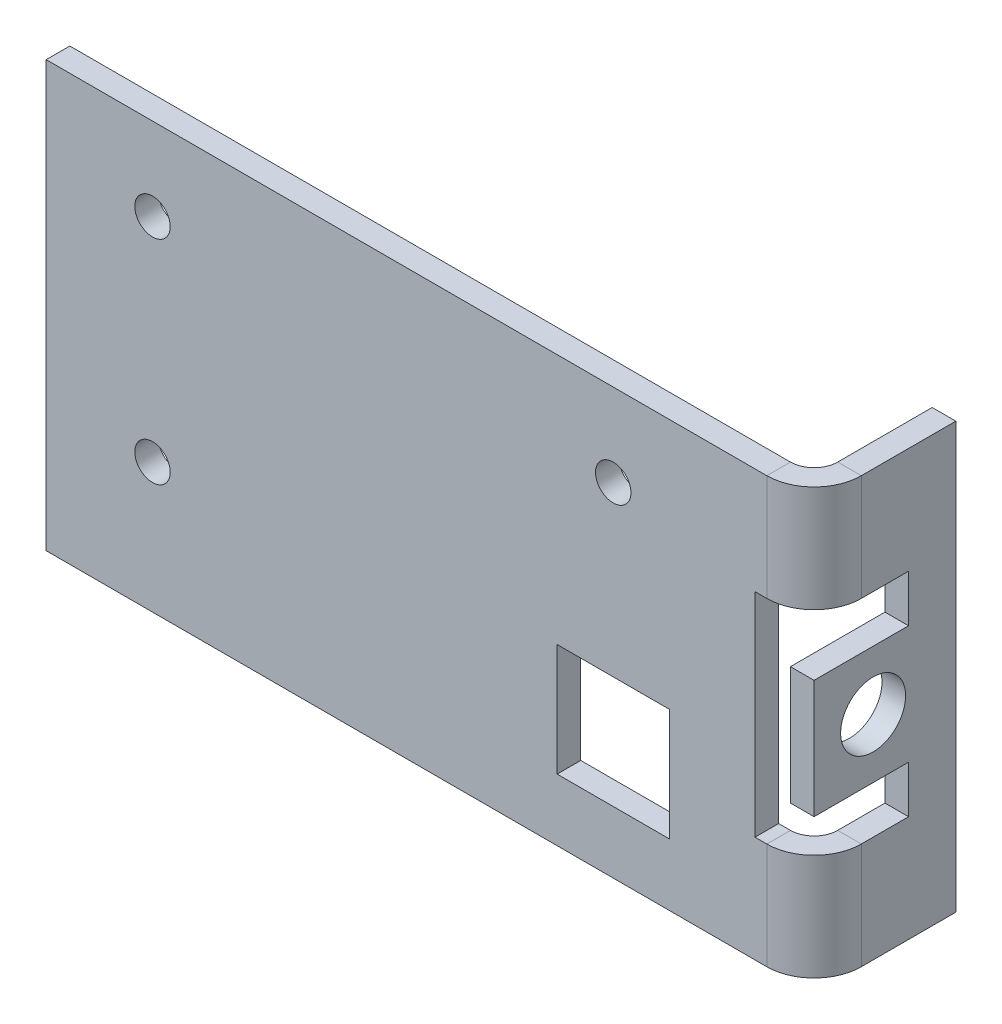
ISO-10303-21;
HEADER;
FILE_DESCRIPTION(('STEP AP214'),'2;1');
FILE_NAME('part.step','',(''),(''),'','','');
FILE_SCHEMA(('AUTOMOTIVE_DESIGN { 1 0 10303 214 1 1 1 1 }'));
ENDSEC;
DATA;
#1=APPLICATION_CONTEXT('core data for automotive mechanical design processes');
#2=APPLICATION_PROTOCOL_DEFINITION('international standard','automotive_design',2000,#1);
#3=PRODUCT_CONTEXT('',#1,'mechanical');
#4=PRODUCT('Part','Part','',(#3));
#5=PRODUCT_RELATED_PRODUCT_CATEGORY('part','',(#4));
#6=PRODUCT_DEFINITION_FORMATION('','',#4);
#7=PRODUCT_DEFINITION_CONTEXT('part definition',#1,'design');
#8=PRODUCT_DEFINITION('design','',#6,#7);
#9=PRODUCT_DEFINITION_SHAPE('','',#8);
#10=(LENGTH_UNIT() NAMED_UNIT(*) SI_UNIT(.MILLI.,.METRE.));
#11=(NAMED_UNIT(*) PLANE_ANGLE_UNIT() SI_UNIT($,.RADIAN.));
#12=(NAMED_UNIT(*) SI_UNIT($,.STERADIAN.) SOLID_ANGLE_UNIT());
#13=UNCERTAINTY_MEASURE_WITH_UNIT(LENGTH_MEASURE(1.E-05),#10,'distance_accuracy_value','');
#14=(GEOMETRIC_REPRESENTATION_CONTEXT(3) GLOBAL_UNCERTAINTY_ASSIGNED_CONTEXT((#13)) GLOBAL_UNIT_ASSIGNED_CONTEXT((#10,
#11,#12)) REPRESENTATION_CONTEXT('',''));
#15=CARTESIAN_POINT('',(0.,0.,0.));
#16=DIRECTION('',(0.,0.,1.));
#17=DIRECTION('',(1.,0.,0.));
#18=AXIS2_PLACEMENT_3D('',#15,#16,#17);
#19=CARTESIAN_POINT('',(-8.00000000000004,36.,-10.));
#20=DIRECTION('',(1.,0.,0.));
#21=DIRECTION('',(0.,0.,-1.));
#22=AXIS2_PLACEMENT_3D('',#19,#20,#21);
#23=PLANE('',#22);
#24=CARTESIAN_POINT('',(-8.00000000000002,18.,-3.));
#25=DIRECTION('',(1.,0.,0.));
#26=DIRECTION('',(0.,0.,-1.));
#27=AXIS2_PLACEMENT_3D('',#24,#25,#26);
#28=CIRCLE('',#27,2.75);
#29=CARTESIAN_POINT('',(-8.00000000000003,18.,-5.75));
#30=VERTEX_POINT('',#29);
#31=EDGE_CURVE('E416',#30,#30,#28,.T.);
#32=ORIENTED_EDGE('',*,*,#31,.F.);
#33=EDGE_LOOP('',(#32));
#34=FACE_BOUND('',#33,.T.);
#35=DIRECTION('',(0.,0.,-1.));
#36=VECTOR('',#35,1.);
#37=CARTESIAN_POINT('',(-7.99999999999999,9.,3.));
#38=LINE('',#37,#36);
#39=CARTESIAN_POINT('',(-8.00000000839993,8.99999999999999,-2.));
#40=VERTEX_POINT('',#39);
#41=CARTESIAN_POINT('',(-8.00000000000003,9.,-6.));
#42=VERTEX_POINT('',#41);
#43=EDGE_CURVE('E243',#40,#42,#38,.T.);
#44=ORIENTED_EDGE('',*,*,#43,.F.);
#45=DIRECTION('',(0.,-1.,0.));
#46=VECTOR('',#45,1.);
#47=CARTESIAN_POINT('',(-8.00000000000001,36.,-2.00000000000002));
#48=LINE('',#47,#46);
#49=CARTESIAN_POINT('',(-8.00000000000001,0.,-2.));
#50=VERTEX_POINT('',#49);
#51=EDGE_CURVE('E210',#40,#50,#48,.T.);
#52=ORIENTED_EDGE('',*,*,#51,.T.);
#53=DIRECTION('',(0.,0.,-1.));
#54=VECTOR('',#53,1.);
#55=CARTESIAN_POINT('',(-8.00000000000004,0.,-10.));
#56=LINE('',#55,#54);
#57=CARTESIAN_POINT('',(-8.00000000000004,0.,-10.));
#58=VERTEX_POINT('',#57);
#59=EDGE_CURVE('E250',#50,#58,#56,.T.);
#60=ORIENTED_EDGE('',*,*,#59,.T.);
#61=DIRECTION('',(0.,1.,0.));
#62=VECTOR('',#61,1.);
#63=CARTESIAN_POINT('',(-8.00000000000004,0.,-10.));
#64=LINE('',#63,#62);
#65=CARTESIAN_POINT('',(-8.00000000000004,36.,-10.));
#66=VERTEX_POINT('',#65);
#67=EDGE_CURVE('E248',#58,#66,#64,.T.);
#68=ORIENTED_EDGE('',*,*,#67,.T.);
#69=DIRECTION('',(0.,0.,1.));
#70=VECTOR('',#69,1.);
#71=CARTESIAN_POINT('',(-8.00000000000004,36.,-10.));
#72=LINE('',#71,#70);
#73=CARTESIAN_POINT('',(-8.00000000839993,36.,-2.00000000000001));
#74=VERTEX_POINT('',#73);
#75=EDGE_CURVE('E253',#66,#74,#72,.T.);
#76=ORIENTED_EDGE('',*,*,#75,.T.);
#77=DIRECTION('',(0.,-1.,0.));
#78=VECTOR('',#77,1.);
#79=CARTESIAN_POINT('',(-8.00000000000001,36.,-2.00000000000001));
#80=LINE('',#79,#78);
#81=CARTESIAN_POINT('',(-8.00000000000001,27.,-2.00000000000001));
#82=VERTEX_POINT('',#81);
#83=EDGE_CURVE('E428',#74,#82,#80,.T.);
#84=ORIENTED_EDGE('',*,*,#83,.T.);
#85=DIRECTION('',(0.,0.,1.));
#86=VECTOR('',#85,1.);
#87=CARTESIAN_POINT('',(-8.00000000000003,27.,-6.));
#88=LINE('',#87,#86);
#89=CARTESIAN_POINT('',(-8.00000000000003,27.,-6.));
#90=VERTEX_POINT('',#89);
#91=EDGE_CURVE('E245',#90,#82,#88,.T.);
#92=ORIENTED_EDGE('',*,*,#91,.F.);
#93=DIRECTION('',(0.,1.,0.));
#94=VECTOR('',#93,1.);
#95=CARTESIAN_POINT('',(-8.00000000000003,23.,-6.));
#96=LINE('',#95,#94);
#97=CARTESIAN_POINT('',(-8.00000000000003,23.,-6.));
#98=VERTEX_POINT('',#97);
#99=EDGE_CURVE('E256',#98,#90,#96,.T.);
#100=ORIENTED_EDGE('',*,*,#99,.F.);
#101=DIRECTION('',(0.,0.,-1.));
#102=VECTOR('',#101,1.);
#103=CARTESIAN_POINT('',(-8.,23.,2.));
#104=LINE('',#103,#102);
#105=CARTESIAN_POINT('',(-8.,23.,2.));
#106=VERTEX_POINT('',#105);
#107=EDGE_CURVE('E398',#106,#98,#104,.T.);
#108=ORIENTED_EDGE('',*,*,#107,.F.);
#109=DIRECTION('',(0.,1.,0.));
#110=VECTOR('',#109,1.);
#111=CARTESIAN_POINT('',(-8.,13.,2.));
#112=LINE('',#111,#110);
#113=CARTESIAN_POINT('',(-8.,13.,2.));
#114=VERTEX_POINT('',#113);
#115=EDGE_CURVE('E395',#114,#106,#112,.T.);
#116=ORIENTED_EDGE('',*,*,#115,.F.);
#117=DIRECTION('',(0.,0.,1.));
#118=VECTOR('',#117,1.);
#119=CARTESIAN_POINT('',(-8.00000000000003,13.,-6.));
#120=LINE('',#119,#118);
#121=CARTESIAN_POINT('',(-8.00000000000003,13.,-6.));
#122=VERTEX_POINT('',#121);
#123=EDGE_CURVE('E393',#122,#114,#120,.T.);
#124=ORIENTED_EDGE('',*,*,#123,.F.);
#125=DIRECTION('',(0.,1.,0.));
#126=VECTOR('',#125,1.);
#127=CARTESIAN_POINT('',(-8.00000000000003,9.,-6.));
#128=LINE('',#127,#126);
#129=EDGE_CURVE('E244',#42,#122,#128,.T.);
#130=ORIENTED_EDGE('',*,*,#129,.F.);
#131=EDGE_LOOP('',(#44,#52,#60,#68,#76,#84,#92,#100,#108,#116,#124,#130));
#132=FACE_BOUND('',#131,.T.);
#133=ADVANCED_FACE('F36',(#34,#132),#23,.T.);
#134=CARTESIAN_POINT('',(-7.99999999999999,9.,3.));
#135=DIRECTION('',(0.,1.,0.));
#136=DIRECTION('',(1.,0.,0.));
#137=AXIS2_PLACEMENT_3D('',#134,#135,#136);
#138=PLANE('',#137);
#139=DIRECTION('',(0.,0.,-1.));
#140=VECTOR('',#139,1.);
#141=CARTESIAN_POINT('',(-9.99999999999999,9.,3.00000000000001));
#142=LINE('',#141,#140);
#143=CARTESIAN_POINT('',(-10.0000000083999,8.99999999999999,-2.));
#144=VERTEX_POINT('',#143);
#145=CARTESIAN_POINT('',(-10.,9.,-5.99999999999999));
#146=VERTEX_POINT('',#145);
#147=EDGE_CURVE('E224',#144,#146,#142,.T.);
#148=ORIENTED_EDGE('',*,*,#147,.F.);
#149=DIRECTION('',(1.,0.,0.));
#150=VECTOR('',#149,1.);
#151=CARTESIAN_POINT('',(-8.00000000000001,9.,-2.00000000000001));
#152=LINE('',#151,#150);
#153=EDGE_CURVE('E200',#144,#40,#152,.T.);
#154=ORIENTED_EDGE('',*,*,#153,.T.);
#155=ORIENTED_EDGE('',*,*,#43,.T.);
#156=DIRECTION('',(-1.,0.,0.));
#157=VECTOR('',#156,1.);
#158=CARTESIAN_POINT('',(-8.00000000000003,9.,-6.));
#159=LINE('',#158,#157);
#160=EDGE_CURVE('E227',#42,#146,#159,.T.);
#161=ORIENTED_EDGE('',*,*,#160,.T.);
#162=EDGE_LOOP('',(#148,#154,#155,#161));
#163=FACE_BOUND('',#162,.T.);
#164=ADVANCED_FACE('F225',(#163),#138,.T.);
#165=CARTESIAN_POINT('',(-8.00000000000003,27.,-6.));
#166=DIRECTION('',(0.,-1.,0.));
#167=DIRECTION('',(-1.,0.,0.));
#168=AXIS2_PLACEMENT_3D('',#165,#166,#167);
#169=PLANE('',#168);
#170=ORIENTED_EDGE('',*,*,#91,.T.);
#171=DIRECTION('',(-1.,0.,0.));
#172=VECTOR('',#171,1.);
#173=CARTESIAN_POINT('',(-8.00000000000001,27.,-2.00000000000001));
#174=LINE('',#173,#172);
#175=CARTESIAN_POINT('',(-10.0000000083999,27.,-2.00000000000001));
#176=VERTEX_POINT('',#175);
#177=EDGE_CURVE('E435',#82,#176,#174,.T.);
#178=ORIENTED_EDGE('',*,*,#177,.T.);
#179=DIRECTION('',(0.,0.,1.));
#180=VECTOR('',#179,1.);
#181=CARTESIAN_POINT('',(-10.,27.,-5.99999999999999));
#182=LINE('',#181,#180);
#183=CARTESIAN_POINT('',(-10.,27.,-5.99999999999999));
#184=VERTEX_POINT('',#183);
#185=EDGE_CURVE('E232',#184,#176,#182,.T.);
#186=ORIENTED_EDGE('',*,*,#185,.F.);
#187=DIRECTION('',(-1.,0.,0.));
#188=VECTOR('',#187,1.);
#189=CARTESIAN_POINT('',(-8.00000000000003,27.,-6.));
#190=LINE('',#189,#188);
#191=EDGE_CURVE('E410',#90,#184,#190,.T.);
#192=ORIENTED_EDGE('',*,*,#191,.F.);
#193=EDGE_LOOP('',(#170,#178,#186,#192));
#194=FACE_BOUND('',#193,.T.);
#195=ADVANCED_FACE('F38',(#194),#169,.T.);
#196=CARTESIAN_POINT('',(-10.,36.,-9.99999999999999));
#197=DIRECTION('',(1.,0.,0.));
#198=DIRECTION('',(0.,0.,-1.));
#199=AXIS2_PLACEMENT_3D('',#196,#197,#198);
#200=PLANE('',#199);
#201=DIRECTION('',(0.,-1.,0.));
#202=VECTOR('',#201,1.);
#203=CARTESIAN_POINT('',(-10.,36.,-2.00000000000002));
#204=LINE('',#203,#202);
#205=CARTESIAN_POINT('',(-10.0000000083999,0.,-2.));
#206=VERTEX_POINT('',#205);
#207=EDGE_CURVE('E45',#144,#206,#204,.T.);
#208=ORIENTED_EDGE('',*,*,#207,.F.);
#209=ORIENTED_EDGE('',*,*,#147,.T.);
#210=DIRECTION('',(0.,1.,0.));
#211=VECTOR('',#210,1.);
#212=CARTESIAN_POINT('',(-10.,9.,-5.99999999999999));
#213=LINE('',#212,#211);
#214=CARTESIAN_POINT('',(-10.,13.,-5.99999999999999));
#215=VERTEX_POINT('',#214);
#216=EDGE_CURVE('E231',#146,#215,#213,.T.);
#217=ORIENTED_EDGE('',*,*,#216,.T.);
#218=DIRECTION('',(0.,0.,1.));
#219=VECTOR('',#218,1.);
#220=CARTESIAN_POINT('',(-10.,13.,-5.99999999999999));
#221=LINE('',#220,#219);
#222=CARTESIAN_POINT('',(-10.,13.,2.00000000000001));
#223=VERTEX_POINT('',#222);
#224=EDGE_CURVE('E382',#215,#223,#221,.T.);
#225=ORIENTED_EDGE('',*,*,#224,.T.);
#226=DIRECTION('',(0.,1.,0.));
#227=VECTOR('',#226,1.);
#228=CARTESIAN_POINT('',(-10.,13.,2.00000000000001));
#229=LINE('',#228,#227);
#230=CARTESIAN_POINT('',(-10.,23.,2.00000000000001));
#231=VERTEX_POINT('',#230);
#232=EDGE_CURVE('E385',#223,#231,#229,.T.);
#233=ORIENTED_EDGE('',*,*,#232,.T.);
#234=DIRECTION('',(0.,0.,-1.));
#235=VECTOR('',#234,1.);
#236=CARTESIAN_POINT('',(-10.,23.,2.00000000000001));
#237=LINE('',#236,#235);
#238=CARTESIAN_POINT('',(-10.,23.,-5.99999999999999));
#239=VERTEX_POINT('',#238);
#240=EDGE_CURVE('E388',#231,#239,#237,.T.);
#241=ORIENTED_EDGE('',*,*,#240,.T.);
#242=DIRECTION('',(0.,1.,0.));
#243=VECTOR('',#242,1.);
#244=CARTESIAN_POINT('',(-10.,23.,-5.99999999999999));
#245=LINE('',#244,#243);
#246=EDGE_CURVE('E259',#239,#184,#245,.T.);
#247=ORIENTED_EDGE('',*,*,#246,.T.);
#248=ORIENTED_EDGE('',*,*,#185,.T.);
#249=DIRECTION('',(0.,-1.,0.));
#250=VECTOR('',#249,1.);
#251=CARTESIAN_POINT('',(-10.,36.,-2.00000000000001));
#252=LINE('',#251,#250);
#253=CARTESIAN_POINT('',(-10.0000000083999,36.,-2.00000000000001));
#254=VERTEX_POINT('',#253);
#255=EDGE_CURVE('E433',#254,#176,#252,.T.);
#256=ORIENTED_EDGE('',*,*,#255,.F.);
#257=DIRECTION('',(0.,0.,1.));
#258=VECTOR('',#257,1.);
#259=CARTESIAN_POINT('',(-10.,36.,-9.99999999999999));
#260=LINE('',#259,#258);
#261=CARTESIAN_POINT('',(-10.,36.,-9.99999999999999));
#262=VERTEX_POINT('',#261);
#263=EDGE_CURVE('E249',#262,#254,#260,.T.);
#264=ORIENTED_EDGE('',*,*,#263,.F.);
#265=DIRECTION('',(0.,1.,0.));
#266=VECTOR('',#265,1.);
#267=CARTESIAN_POINT('',(-10.,0.,-9.99999999999999));
#268=LINE('',#267,#266);
#269=CARTESIAN_POINT('',(-10.,0.,-9.99999999999999));
#270=VERTEX_POINT('',#269);
#271=EDGE_CURVE('E262',#270,#262,#268,.T.);
#272=ORIENTED_EDGE('',*,*,#271,.F.);
#273=DIRECTION('',(0.,0.,-1.));
#274=VECTOR('',#273,1.);
#275=CARTESIAN_POINT('',(-10.,0.,-9.99999999999999));
#276=LINE('',#275,#274);
#277=EDGE_CURVE('E238',#206,#270,#276,.T.);
#278=ORIENTED_EDGE('',*,*,#277,.F.);
#279=EDGE_LOOP('',(#208,#209,#217,#225,#233,#241,#247,#248,#256,#264,#272,#278));
#280=FACE_BOUND('',#279,.T.);
#281=CARTESIAN_POINT('',(-10.,18.,-2.99999999999999));
#282=DIRECTION('',(1.,0.,0.));
#283=DIRECTION('',(0.,0.,-1.));
#284=AXIS2_PLACEMENT_3D('',#281,#282,#283);
#285=CIRCLE('',#284,2.75);
#286=CARTESIAN_POINT('',(-10.,18.,-5.74999999999999));
#287=VERTEX_POINT('',#286);
#288=EDGE_CURVE('E413',#287,#287,#285,.T.);
#289=ORIENTED_EDGE('',*,*,#288,.T.);
#290=EDGE_LOOP('',(#289));
#291=FACE_BOUND('',#290,.T.);
#292=ADVANCED_FACE('F235',(#280,#291),#200,.F.);
#293=CARTESIAN_POINT('',(-8.00000000000004,0.,-10.));
#294=DIRECTION('',(0.,0.,1.));
#295=DIRECTION('',(1.,0.,0.));
#296=AXIS2_PLACEMENT_3D('',#293,#294,#295);
#297=PLANE('',#296);
#298=ORIENTED_EDGE('',*,*,#271,.T.);
#299=DIRECTION('',(-1.,0.,0.));
#300=VECTOR('',#299,1.);
#301=CARTESIAN_POINT('',(-8.00000000000004,36.,-10.));
#302=LINE('',#301,#300);
#303=EDGE_CURVE('E425',#66,#262,#302,.T.);
#304=ORIENTED_EDGE('',*,*,#303,.F.);
#305=ORIENTED_EDGE('',*,*,#67,.F.);
#306=DIRECTION('',(-1.,0.,0.));
#307=VECTOR('',#306,1.);
#308=CARTESIAN_POINT('',(-8.00000000000004,0.,-10.));
#309=LINE('',#308,#307);
#310=EDGE_CURVE('E252',#58,#270,#309,.T.);
#311=ORIENTED_EDGE('',*,*,#310,.T.);
#312=EDGE_LOOP('',(#298,#304,#305,#311));
#313=FACE_BOUND('',#312,.T.);
#314=ADVANCED_FACE('F447',(#313),#297,.F.);
#315=CARTESIAN_POINT('',(-8.00000000000004,36.,-10.));
#316=DIRECTION('',(0.,-1.,0.));
#317=DIRECTION('',(-1.,0.,0.));
#318=AXIS2_PLACEMENT_3D('',#315,#316,#317);
#319=PLANE('',#318);
#320=DIRECTION('',(-1.,0.,0.));
#321=VECTOR('',#320,1.);
#322=CARTESIAN_POINT('',(-8.00000000000001,36.,-2.00000000000001));
#323=LINE('',#322,#321);
#324=EDGE_CURVE('E431',#74,#254,#323,.T.);
#325=ORIENTED_EDGE('',*,*,#324,.F.);
#326=ORIENTED_EDGE('',*,*,#75,.F.);
#327=ORIENTED_EDGE('',*,*,#303,.T.);
#328=ORIENTED_EDGE('',*,*,#263,.T.);
#329=EDGE_LOOP('',(#325,#326,#327,#328));
#330=FACE_BOUND('',#329,.T.);
#331=ADVANCED_FACE('F451',(#330),#319,.F.);
#332=CARTESIAN_POINT('',(-8.00000000000004,0.,-10.));
#333=DIRECTION('',(0.,1.,0.));
#334=DIRECTION('',(0.,0.,1.));
#335=AXIS2_PLACEMENT_3D('',#332,#333,#334);
#336=PLANE('',#335);
#337=DIRECTION('',(1.,0.,0.));
#338=VECTOR('',#337,1.);
#339=CARTESIAN_POINT('',(-8.00000000000001,0.,-2.));
#340=LINE('',#339,#338);
#341=EDGE_CURVE('E12',#206,#50,#340,.T.);
#342=ORIENTED_EDGE('',*,*,#341,.F.);
#343=ORIENTED_EDGE('',*,*,#277,.T.);
#344=ORIENTED_EDGE('',*,*,#310,.F.);
#345=ORIENTED_EDGE('',*,*,#59,.F.);
#346=EDGE_LOOP('',(#342,#343,#344,#345));
#347=FACE_BOUND('',#346,.T.);
#348=ADVANCED_FACE('F443',(#347),#336,.F.);
#349=CARTESIAN_POINT('',(-8.00000000000002,18.,-3.));
#350=DIRECTION('',(-1.,0.,0.));
#351=DIRECTION('',(0.,0.,1.));
#352=AXIS2_PLACEMENT_3D('',#349,#350,#351);
#353=CYLINDRICAL_SURFACE('',#352,2.75);
#354=ORIENTED_EDGE('',*,*,#31,.T.);
#355=EDGE_LOOP('',(#354));
#356=FACE_BOUND('',#355,.T.);
#357=ORIENTED_EDGE('',*,*,#288,.F.);
#358=EDGE_LOOP('',(#357));
#359=FACE_BOUND('',#358,.T.);
#360=ADVANCED_FACE('F515',(#356,#359),#353,.F.);
#361=CARTESIAN_POINT('',(-8.00000000000003,23.,-6.));
#362=DIRECTION('',(0.,0.,1.));
#363=DIRECTION('',(1.,0.,0.));
#364=AXIS2_PLACEMENT_3D('',#361,#362,#363);
#365=PLANE('',#364);
#366=ORIENTED_EDGE('',*,*,#246,.F.);
#367=DIRECTION('',(-1.,0.,0.));
#368=VECTOR('',#367,1.);
#369=CARTESIAN_POINT('',(-8.00000000000003,23.,-6.));
#370=LINE('',#369,#368);
#371=EDGE_CURVE('E400',#98,#239,#370,.T.);
#372=ORIENTED_EDGE('',*,*,#371,.F.);
#373=ORIENTED_EDGE('',*,*,#99,.T.);
#374=ORIENTED_EDGE('',*,*,#191,.T.);
#375=EDGE_LOOP('',(#366,#372,#373,#374));
#376=FACE_BOUND('',#375,.T.);
#377=ADVANCED_FACE('F493',(#376),#365,.T.);
#378=CARTESIAN_POINT('',(-8.00000000000003,9.,-6.));
#379=DIRECTION('',(0.,0.,1.));
#380=DIRECTION('',(1.,0.,0.));
#381=AXIS2_PLACEMENT_3D('',#378,#379,#380);
#382=PLANE('',#381);
#383=ORIENTED_EDGE('',*,*,#216,.F.);
#384=ORIENTED_EDGE('',*,*,#160,.F.);
#385=ORIENTED_EDGE('',*,*,#129,.T.);
#386=DIRECTION('',(-1.,0.,0.));
#387=VECTOR('',#386,1.);
#388=CARTESIAN_POINT('',(-8.00000000000003,13.,-6.));
#389=LINE('',#388,#387);
#390=EDGE_CURVE('E407',#122,#215,#389,.T.);
#391=ORIENTED_EDGE('',*,*,#390,.T.);
#392=EDGE_LOOP('',(#383,#384,#385,#391));
#393=FACE_BOUND('',#392,.T.);
#394=ADVANCED_FACE('F507',(#393),#382,.T.);
#395=CARTESIAN_POINT('',(-8.00000000000003,13.,-6.));
#396=DIRECTION('',(0.,-1.,0.));
#397=DIRECTION('',(-1.,0.,0.));
#398=AXIS2_PLACEMENT_3D('',#395,#396,#397);
#399=PLANE('',#398);
#400=ORIENTED_EDGE('',*,*,#224,.F.);
#401=ORIENTED_EDGE('',*,*,#390,.F.);
#402=ORIENTED_EDGE('',*,*,#123,.T.);
#403=DIRECTION('',(-1.,0.,0.));
#404=VECTOR('',#403,1.);
#405=CARTESIAN_POINT('',(-8.,13.,2.));
#406=LINE('',#405,#404);
#407=EDGE_CURVE('E405',#114,#223,#406,.T.);
#408=ORIENTED_EDGE('',*,*,#407,.T.);
#409=EDGE_LOOP('',(#400,#401,#402,#408));
#410=FACE_BOUND('',#409,.T.);
#411=ADVANCED_FACE('F505',(#410),#399,.T.);
#412=CARTESIAN_POINT('',(-8.,13.,2.));
#413=DIRECTION('',(0.,0.,1.));
#414=DIRECTION('',(1.,0.,0.));
#415=AXIS2_PLACEMENT_3D('',#412,#413,#414);
#416=PLANE('',#415);
#417=ORIENTED_EDGE('',*,*,#232,.F.);
#418=ORIENTED_EDGE('',*,*,#407,.F.);
#419=ORIENTED_EDGE('',*,*,#115,.T.);
#420=DIRECTION('',(-1.,0.,0.));
#421=VECTOR('',#420,1.);
#422=CARTESIAN_POINT('',(-8.,23.,2.));
#423=LINE('',#422,#421);
#424=EDGE_CURVE('E403',#106,#231,#423,.T.);
#425=ORIENTED_EDGE('',*,*,#424,.T.);
#426=EDGE_LOOP('',(#417,#418,#419,#425));
#427=FACE_BOUND('',#426,.T.);
#428=ADVANCED_FACE('F501',(#427),#416,.T.);
#429=CARTESIAN_POINT('',(-8.,23.,2.));
#430=DIRECTION('',(0.,1.,0.));
#431=DIRECTION('',(1.,0.,0.));
#432=AXIS2_PLACEMENT_3D('',#429,#430,#431);
#433=PLANE('',#432);
#434=ORIENTED_EDGE('',*,*,#240,.F.);
#435=ORIENTED_EDGE('',*,*,#424,.F.);
#436=ORIENTED_EDGE('',*,*,#107,.T.);
#437=ORIENTED_EDGE('',*,*,#371,.T.);
#438=EDGE_LOOP('',(#434,#435,#436,#437));
#439=FACE_BOUND('',#438,.T.);
#440=ADVANCED_FACE('F496',(#439),#433,.T.);
#441=CARTESIAN_POINT('',(-20.25,14.75,2.));
#442=DIRECTION('',(-1.,0.,0.));
#443=DIRECTION('',(0.,0.,1.));
#444=AXIS2_PLACEMENT_3D('',#441,#442,#443);
#445=PLANE('',#444);
#446=DIRECTION('',(0.,1.,0.));
#447=VECTOR('',#446,1.);
#448=CARTESIAN_POINT('',(-20.25,14.75,0.));
#449=LINE('',#448,#447);
#450=CARTESIAN_POINT('',(-20.25,5.24999999999999,0.));
#451=VERTEX_POINT('',#450);
#452=CARTESIAN_POINT('',(-20.25,14.75,0.));
#453=VERTEX_POINT('',#452);
#454=EDGE_CURVE('E324',#451,#453,#449,.T.);
#455=ORIENTED_EDGE('',*,*,#454,.F.);
#456=DIRECTION('',(0.,0.,-1.));
#457=VECTOR('',#456,1.);
#458=CARTESIAN_POINT('',(-20.25,5.24999999999999,2.));
#459=LINE('',#458,#457);
#460=CARTESIAN_POINT('',(-20.25,5.24999999999999,2.));
#461=VERTEX_POINT('',#460);
#462=EDGE_CURVE('E353',#461,#451,#459,.T.);
#463=ORIENTED_EDGE('',*,*,#462,.F.);
#464=DIRECTION('',(0.,1.,0.));
#465=VECTOR('',#464,1.);
#466=CARTESIAN_POINT('',(-20.25,14.75,2.));
#467=LINE('',#466,#465);
#468=CARTESIAN_POINT('',(-20.25,14.75,2.));
#469=VERTEX_POINT('',#468);
#470=EDGE_CURVE('E369',#461,#469,#467,.T.);
#471=ORIENTED_EDGE('',*,*,#470,.T.);
#472=DIRECTION('',(0.,0.,-1.));
#473=VECTOR('',#472,1.);
#474=CARTESIAN_POINT('',(-20.25,14.75,2.));
#475=LINE('',#474,#473);
#476=EDGE_CURVE('E367',#469,#453,#475,.T.);
#477=ORIENTED_EDGE('',*,*,#476,.T.);
#478=EDGE_LOOP('',(#455,#463,#471,#477));
#479=FACE_BOUND('',#478,.T.);
#480=ADVANCED_FACE('F548',(#479),#445,.T.);
#481=CARTESIAN_POINT('',(-29.75,14.75,2.));
#482=DIRECTION('',(0.,-1.,0.));
#483=DIRECTION('',(1.,0.,0.));
#484=AXIS2_PLACEMENT_3D('',#481,#482,#483);
#485=PLANE('',#484);
#486=DIRECTION('',(-1.,0.,0.));
#487=VECTOR('',#486,1.);
#488=CARTESIAN_POINT('',(-29.75,14.75,0.));
#489=LINE('',#488,#487);
#490=CARTESIAN_POINT('',(-29.75,14.75,0.));
#491=VERTEX_POINT('',#490);
#492=EDGE_CURVE('E321',#453,#491,#489,.T.);
#493=ORIENTED_EDGE('',*,*,#492,.F.);
#494=ORIENTED_EDGE('',*,*,#476,.F.);
#495=DIRECTION('',(-1.,0.,0.));
#496=VECTOR('',#495,1.);
#497=CARTESIAN_POINT('',(-29.75,14.75,2.));
#498=LINE('',#497,#496);
#499=CARTESIAN_POINT('',(-29.75,14.75,2.));
#500=VERTEX_POINT('',#499);
#501=EDGE_CURVE('E365',#469,#500,#498,.T.);
#502=ORIENTED_EDGE('',*,*,#501,.T.);
#503=DIRECTION('',(0.,0.,-1.));
#504=VECTOR('',#503,1.);
#505=CARTESIAN_POINT('',(-29.75,14.75,2.));
#506=LINE('',#505,#504);
#507=EDGE_CURVE('E362',#500,#491,#506,.T.);
#508=ORIENTED_EDGE('',*,*,#507,.T.);
#509=EDGE_LOOP('',(#493,#494,#502,#508));
#510=FACE_BOUND('',#509,.T.);
#511=ADVANCED_FACE('F554',(#510),#485,.T.);
#512=CARTESIAN_POINT('',(-29.75,14.75,2.));
#513=DIRECTION('',(1.,0.,0.));
#514=DIRECTION('',(0.,0.,-1.));
#515=AXIS2_PLACEMENT_3D('',#512,#513,#514);
#516=PLANE('',#515);
#517=DIRECTION('',(0.,-1.,0.));
#518=VECTOR('',#517,1.);
#519=CARTESIAN_POINT('',(-29.75,14.75,0.));
#520=LINE('',#519,#518);
#521=CARTESIAN_POINT('',(-29.75,5.24999999999999,0.));
#522=VERTEX_POINT('',#521);
#523=EDGE_CURVE('E330',#491,#522,#520,.T.);
#524=ORIENTED_EDGE('',*,*,#523,.F.);
#525=ORIENTED_EDGE('',*,*,#507,.F.);
#526=DIRECTION('',(0.,-1.,0.));
#527=VECTOR('',#526,1.);
#528=CARTESIAN_POINT('',(-29.75,14.75,2.));
#529=LINE('',#528,#527);
#530=CARTESIAN_POINT('',(-29.75,5.24999999999999,2.));
#531=VERTEX_POINT('',#530);
#532=EDGE_CURVE('E360',#500,#531,#529,.T.);
#533=ORIENTED_EDGE('',*,*,#532,.T.);
#534=DIRECTION('',(0.,0.,-1.));
#535=VECTOR('',#534,1.);
#536=CARTESIAN_POINT('',(-29.75,5.24999999999999,2.));
#537=LINE('',#536,#535);
#538=EDGE_CURVE('E357',#531,#522,#537,.T.);
#539=ORIENTED_EDGE('',*,*,#538,.T.);
#540=EDGE_LOOP('',(#524,#525,#533,#539));
#541=FACE_BOUND('',#540,.T.);
#542=ADVANCED_FACE('F565',(#541),#516,.T.);
#543=CARTESIAN_POINT('',(-29.75,5.24999999999999,2.));
#544=DIRECTION('',(0.,1.,0.));
#545=DIRECTION('',(-1.,0.,0.));
#546=AXIS2_PLACEMENT_3D('',#543,#544,#545);
#547=PLANE('',#546);
#548=DIRECTION('',(1.,0.,0.));
#549=VECTOR('',#548,1.);
#550=CARTESIAN_POINT('',(-29.75,5.24999999999999,0.));
#551=LINE('',#550,#549);
#552=EDGE_CURVE('E327',#522,#451,#551,.T.);
#553=ORIENTED_EDGE('',*,*,#552,.F.);
#554=ORIENTED_EDGE('',*,*,#538,.F.);
#555=DIRECTION('',(1.,0.,0.));
#556=VECTOR('',#555,1.);
#557=CARTESIAN_POINT('',(-29.75,5.24999999999999,2.));
#558=LINE('',#557,#556);
#559=EDGE_CURVE('E355',#531,#461,#558,.T.);
#560=ORIENTED_EDGE('',*,*,#559,.T.);
#561=ORIENTED_EDGE('',*,*,#462,.T.);
#562=EDGE_LOOP('',(#553,#554,#560,#561));
#563=FACE_BOUND('',#562,.T.);
#564=ADVANCED_FACE('F575',(#563),#547,.T.);
#565=CARTESIAN_POINT('',(-73.,0.,2.));
#566=DIRECTION('',(1.,0.,0.));
#567=DIRECTION('',(0.,0.,-1.));
#568=AXIS2_PLACEMENT_3D('',#565,#566,#567);
#569=PLANE('',#568);
#570=DIRECTION('',(0.,-1.,0.));
#571=VECTOR('',#570,1.);
#572=CARTESIAN_POINT('',(-73.,0.,0.));
#573=LINE('',#572,#571);
#574=CARTESIAN_POINT('',(-73.,36.,0.));
#575=VERTEX_POINT('',#574);
#576=CARTESIAN_POINT('',(-73.,0.,0.));
#577=VERTEX_POINT('',#576);
#578=EDGE_CURVE('E351',#575,#577,#573,.T.);
#579=ORIENTED_EDGE('',*,*,#578,.T.);
#580=DIRECTION('',(0.,0.,-1.));
#581=VECTOR('',#580,1.);
#582=CARTESIAN_POINT('',(-73.,0.,2.));
#583=LINE('',#582,#581);
#584=CARTESIAN_POINT('',(-73.,0.,2.));
#585=VERTEX_POINT('',#584);
#586=EDGE_CURVE('E295',#585,#577,#583,.T.);
#587=ORIENTED_EDGE('',*,*,#586,.F.);
#588=DIRECTION('',(0.,-1.,0.));
#589=VECTOR('',#588,1.);
#590=CARTESIAN_POINT('',(-73.,0.,2.));
#591=LINE('',#590,#589);
#592=CARTESIAN_POINT('',(-73.,36.,2.));
#593=VERTEX_POINT('',#592);
#594=EDGE_CURVE('E340',#593,#585,#591,.T.);
#595=ORIENTED_EDGE('',*,*,#594,.F.);
#596=DIRECTION('',(0.,0.,-1.));
#597=VECTOR('',#596,1.);
#598=CARTESIAN_POINT('',(-73.,36.,2.));
#599=LINE('',#598,#597);
#600=EDGE_CURVE('E348',#593,#575,#599,.T.);
#601=ORIENTED_EDGE('',*,*,#600,.T.);
#602=EDGE_LOOP('',(#579,#587,#595,#601));
#603=FACE_BOUND('',#602,.T.);
#604=ADVANCED_FACE('F585',(#603),#569,.F.);
#605=CARTESIAN_POINT('',(-13.,27.,2.));
#606=DIRECTION('',(1.,0.,0.));
#607=DIRECTION('',(0.,1.,0.));
#608=AXIS2_PLACEMENT_3D('',#605,#606,#607);
#609=PLANE('',#608);
#610=DIRECTION('',(0.,-1.,0.));
#611=VECTOR('',#610,1.);
#612=CARTESIAN_POINT('',(-13.,27.,0.));
#613=LINE('',#612,#611);
#614=CARTESIAN_POINT('',(-13.,27.,0.));
#615=VERTEX_POINT('',#614);
#616=CARTESIAN_POINT('',(-13.,9.,0.));
#617=VERTEX_POINT('',#616);
#618=EDGE_CURVE('E310',#615,#617,#613,.T.);
#619=ORIENTED_EDGE('',*,*,#618,.F.);
#620=DIRECTION('',(0.,0.,-1.));
#621=VECTOR('',#620,1.);
#622=CARTESIAN_POINT('',(-13.,27.,2.));
#623=LINE('',#622,#621);
#624=CARTESIAN_POINT('',(-13.,27.,2.));
#625=VERTEX_POINT('',#624);
#626=EDGE_CURVE('E305',#625,#615,#623,.T.);
#627=ORIENTED_EDGE('',*,*,#626,.F.);
#628=DIRECTION('',(0.,-1.,0.));
#629=VECTOR('',#628,1.);
#630=CARTESIAN_POINT('',(-13.,27.,2.));
#631=LINE('',#630,#629);
#632=CARTESIAN_POINT('',(-13.,9.,2.));
#633=VERTEX_POINT('',#632);
#634=EDGE_CURVE('E346',#625,#633,#631,.T.);
#635=ORIENTED_EDGE('',*,*,#634,.T.);
#636=DIRECTION('',(0.,0.,-1.));
#637=VECTOR('',#636,1.);
#638=CARTESIAN_POINT('',(-13.,9.,2.));
#639=LINE('',#638,#637);
#640=EDGE_CURVE('E344',#633,#617,#639,.T.);
#641=ORIENTED_EDGE('',*,*,#640,.T.);
#642=EDGE_LOOP('',(#619,#627,#635,#641));
#643=FACE_BOUND('',#642,.T.);
#644=ADVANCED_FACE('F595',(#643),#609,.T.);
#645=CARTESIAN_POINT('',(0.,36.,2.));
#646=DIRECTION('',(0.,0.,1.));
#647=DIRECTION('',(1.,0.,0.));
#648=AXIS2_PLACEMENT_3D('',#645,#646,#647);
#649=PLANE('',#648);
#650=CARTESIAN_POINT('',(-64.,29.,2.));
#651=DIRECTION('',(0.,0.,1.));
#652=DIRECTION('',(1.,0.,0.));
#653=AXIS2_PLACEMENT_3D('',#650,#651,#652);
#654=CIRCLE('',#653,1.5);
#655=CARTESIAN_POINT('',(-62.5,29.,2.));
#656=VERTEX_POINT('',#655);
#657=EDGE_CURVE('E279',#656,#656,#654,.T.);
#658=ORIENTED_EDGE('',*,*,#657,.F.);
#659=EDGE_LOOP('',(#658));
#660=FACE_BOUND('',#659,.T.);
#661=CARTESIAN_POINT('',(-64.,11.,2.));
#662=DIRECTION('',(0.,0.,1.));
#663=DIRECTION('',(1.,0.,0.));
#664=AXIS2_PLACEMENT_3D('',#661,#662,#663);
#665=CIRCLE('',#664,1.5);
#666=CARTESIAN_POINT('',(-62.5,11.,2.));
#667=VERTEX_POINT('',#666);
#668=EDGE_CURVE('E269',#667,#667,#665,.T.);
#669=ORIENTED_EDGE('',*,*,#668,.F.);
#670=EDGE_LOOP('',(#669));
#671=FACE_BOUND('',#670,.T.);
#672=CARTESIAN_POINT('',(-25.,29.,2.));
#673=DIRECTION('',(0.,0.,1.));
#674=DIRECTION('',(1.,0.,0.));
#675=AXIS2_PLACEMENT_3D('',#672,#673,#674);
#676=CIRCLE('',#675,1.5);
#677=CARTESIAN_POINT('',(-23.5,29.,2.));
#678=VERTEX_POINT('',#677);
#679=EDGE_CURVE('E266',#678,#678,#676,.T.);
#680=ORIENTED_EDGE('',*,*,#679,.F.);
#681=EDGE_LOOP('',(#680));
#682=FACE_BOUND('',#681,.T.);
#683=DIRECTION('',(0.,-1.,0.));
#684=VECTOR('',#683,1.);
#685=CARTESIAN_POINT('',(-12.,36.,2.));
#686=LINE('',#685,#684);
#687=CARTESIAN_POINT('',(-12.,8.99999999999999,1.99999999580004));
#688=VERTEX_POINT('',#687);
#689=CARTESIAN_POINT('',(-12.,0.,2.));
#690=VERTEX_POINT('',#689);
#691=EDGE_CURVE('E294',#688,#690,#686,.T.);
#692=ORIENTED_EDGE('',*,*,#691,.F.);
#693=DIRECTION('',(1.,0.,0.));
#694=VECTOR('',#693,1.);
#695=CARTESIAN_POINT('',(-13.,9.,2.));
#696=LINE('',#695,#694);
#697=EDGE_CURVE('E303',#633,#688,#696,.T.);
#698=ORIENTED_EDGE('',*,*,#697,.F.);
#699=ORIENTED_EDGE('',*,*,#634,.F.);
#700=DIRECTION('',(-1.,0.,0.));
#701=VECTOR('',#700,1.);
#702=CARTESIAN_POINT('',(-4.,27.,2.));
#703=LINE('',#702,#701);
#704=CARTESIAN_POINT('',(-12.,27.,1.99999999160008));
#705=VERTEX_POINT('',#704);
#706=EDGE_CURVE('E308',#705,#625,#703,.T.);
#707=ORIENTED_EDGE('',*,*,#706,.F.);
#708=DIRECTION('',(0.,-1.,0.));
#709=VECTOR('',#708,1.);
#710=CARTESIAN_POINT('',(-12.,36.,2.));
#711=LINE('',#710,#709);
#712=CARTESIAN_POINT('',(-12.,36.,1.99999999580004));
#713=VERTEX_POINT('',#712);
#714=EDGE_CURVE('E374',#713,#705,#711,.T.);
#715=ORIENTED_EDGE('',*,*,#714,.F.);
#716=DIRECTION('',(-1.,0.,0.));
#717=VECTOR('',#716,1.);
#718=CARTESIAN_POINT('',(0.,36.,2.));
#719=LINE('',#718,#717);
#720=EDGE_CURVE('E342',#713,#593,#719,.T.);
#721=ORIENTED_EDGE('',*,*,#720,.T.);
#722=ORIENTED_EDGE('',*,*,#594,.T.);
#723=DIRECTION('',(1.,0.,0.));
#724=VECTOR('',#723,1.);
#725=CARTESIAN_POINT('',(0.,0.,2.));
#726=LINE('',#725,#724);
#727=EDGE_CURVE('E338',#585,#690,#726,.T.);
#728=ORIENTED_EDGE('',*,*,#727,.T.);
#729=EDGE_LOOP('',(#692,#698,#699,#707,#715,#721,#722,#728));
#730=FACE_BOUND('',#729,.T.);
#731=ORIENTED_EDGE('',*,*,#559,.F.);
#732=ORIENTED_EDGE('',*,*,#532,.F.);
#733=ORIENTED_EDGE('',*,*,#501,.F.);
#734=ORIENTED_EDGE('',*,*,#470,.F.);
#735=EDGE_LOOP('',(#731,#732,#733,#734));
#736=FACE_BOUND('',#735,.T.);
#737=ADVANCED_FACE('F476',(#660,#671,#682,#730,#736),#649,.T.);
#738=CARTESIAN_POINT('',(0.,36.,2.));
#739=DIRECTION('',(0.,-1.,0.));
#740=DIRECTION('',(0.,0.,-1.));
#741=AXIS2_PLACEMENT_3D('',#738,#739,#740);
#742=PLANE('',#741);
#743=ORIENTED_EDGE('',*,*,#720,.F.);
#744=DIRECTION('',(0.,0.,-1.));
#745=VECTOR('',#744,1.);
#746=CARTESIAN_POINT('',(-12.,36.,2.));
#747=LINE('',#746,#745);
#748=CARTESIAN_POINT('',(-12.,36.,0.));
#749=VERTEX_POINT('',#748);
#750=EDGE_CURVE('E335',#713,#749,#747,.T.);
#751=ORIENTED_EDGE('',*,*,#750,.T.);
#752=DIRECTION('',(-1.,0.,0.));
#753=VECTOR('',#752,1.);
#754=CARTESIAN_POINT('',(0.,36.,0.));
#755=LINE('',#754,#753);
#756=EDGE_CURVE('E333',#749,#575,#755,.T.);
#757=ORIENTED_EDGE('',*,*,#756,.T.);
#758=ORIENTED_EDGE('',*,*,#600,.F.);
#759=EDGE_LOOP('',(#743,#751,#757,#758));
#760=FACE_BOUND('',#759,.T.);
#761=ADVANCED_FACE('F470',(#760),#742,.F.);
#762=CARTESIAN_POINT('',(0.,36.,0.));
#763=DIRECTION('',(0.,0.,1.));
#764=DIRECTION('',(1.,0.,0.));
#765=AXIS2_PLACEMENT_3D('',#762,#763,#764);
#766=PLANE('',#765);
#767=CARTESIAN_POINT('',(-64.,29.,0.));
#768=DIRECTION('',(0.,0.,1.));
#769=DIRECTION('',(1.,0.,0.));
#770=AXIS2_PLACEMENT_3D('',#767,#768,#769);
#771=CIRCLE('',#770,1.5);
#772=CARTESIAN_POINT('',(-62.5,29.,0.));
#773=VERTEX_POINT('',#772);
#774=EDGE_CURVE('E40',#773,#773,#771,.T.);
#775=ORIENTED_EDGE('',*,*,#774,.T.);
#776=EDGE_LOOP('',(#775));
#777=FACE_BOUND('',#776,.T.);
#778=CARTESIAN_POINT('',(-64.,11.,0.));
#779=DIRECTION('',(0.,0.,1.));
#780=DIRECTION('',(1.,0.,0.));
#781=AXIS2_PLACEMENT_3D('',#778,#779,#780);
#782=CIRCLE('',#781,1.5);
#783=CARTESIAN_POINT('',(-62.5,11.,0.));
#784=VERTEX_POINT('',#783);
#785=EDGE_CURVE('E267',#784,#784,#782,.T.);
#786=ORIENTED_EDGE('',*,*,#785,.T.);
#787=EDGE_LOOP('',(#786));
#788=FACE_BOUND('',#787,.T.);
#789=CARTESIAN_POINT('',(-25.,29.,0.));
#790=DIRECTION('',(0.,0.,1.));
#791=DIRECTION('',(1.,0.,0.));
#792=AXIS2_PLACEMENT_3D('',#789,#790,#791);
#793=CIRCLE('',#792,1.5);
#794=CARTESIAN_POINT('',(-23.5,29.,0.));
#795=VERTEX_POINT('',#794);
#796=EDGE_CURVE('E221',#795,#795,#793,.T.);
#797=ORIENTED_EDGE('',*,*,#796,.T.);
#798=EDGE_LOOP('',(#797));
#799=FACE_BOUND('',#798,.T.);
#800=ORIENTED_EDGE('',*,*,#523,.T.);
#801=ORIENTED_EDGE('',*,*,#552,.T.);
#802=ORIENTED_EDGE('',*,*,#454,.T.);
#803=ORIENTED_EDGE('',*,*,#492,.T.);
#804=EDGE_LOOP('',(#800,#801,#802,#803));
#805=FACE_BOUND('',#804,.T.);
#806=DIRECTION('',(1.,0.,0.));
#807=VECTOR('',#806,1.);
#808=CARTESIAN_POINT('',(-13.,9.,0.));
#809=LINE('',#808,#807);
#810=CARTESIAN_POINT('',(-12.,9.,0.));
#811=VERTEX_POINT('',#810);
#812=EDGE_CURVE('E319',#617,#811,#809,.T.);
#813=ORIENTED_EDGE('',*,*,#812,.T.);
#814=DIRECTION('',(0.,-1.,0.));
#815=VECTOR('',#814,1.);
#816=CARTESIAN_POINT('',(-12.,36.,0.));
#817=LINE('',#816,#815);
#818=CARTESIAN_POINT('',(-12.,0.,0.));
#819=VERTEX_POINT('',#818);
#820=EDGE_CURVE('E219',#811,#819,#817,.T.);
#821=ORIENTED_EDGE('',*,*,#820,.T.);
#822=DIRECTION('',(1.,0.,0.));
#823=VECTOR('',#822,1.);
#824=CARTESIAN_POINT('',(0.,0.,0.));
#825=LINE('',#824,#823);
#826=EDGE_CURVE('E301',#577,#819,#825,.T.);
#827=ORIENTED_EDGE('',*,*,#826,.F.);
#828=ORIENTED_EDGE('',*,*,#578,.F.);
#829=ORIENTED_EDGE('',*,*,#756,.F.);
#830=DIRECTION('',(0.,-1.,0.));
#831=VECTOR('',#830,1.);
#832=CARTESIAN_POINT('',(-12.,36.,0.));
#833=LINE('',#832,#831);
#834=CARTESIAN_POINT('',(-12.,27.,-8.39991617929137E-09));
#835=VERTEX_POINT('',#834);
#836=EDGE_CURVE('E315',#749,#835,#833,.T.);
#837=ORIENTED_EDGE('',*,*,#836,.T.);
#838=DIRECTION('',(-1.,0.,0.));
#839=VECTOR('',#838,1.);
#840=CARTESIAN_POINT('',(-4.,27.,0.));
#841=LINE('',#840,#839);
#842=EDGE_CURVE('E313',#835,#615,#841,.T.);
#843=ORIENTED_EDGE('',*,*,#842,.T.);
#844=ORIENTED_EDGE('',*,*,#618,.T.);
#845=EDGE_LOOP('',(#813,#821,#827,#828,#829,#837,#843,#844));
#846=FACE_BOUND('',#845,.T.);
#847=ADVANCED_FACE('F465',(#777,#788,#799,#805,#846),#766,.F.);
#848=CARTESIAN_POINT('',(-4.,27.,2.));
#849=DIRECTION('',(0.,-1.,0.));
#850=DIRECTION('',(0.,0.,-1.));
#851=AXIS2_PLACEMENT_3D('',#848,#849,#850);
#852=PLANE('',#851);
#853=DIRECTION('',(0.,0.,-1.));
#854=VECTOR('',#853,1.);
#855=CARTESIAN_POINT('',(-12.,27.,2.));
#856=LINE('',#855,#854);
#857=EDGE_CURVE('E372',#705,#835,#856,.T.);
#858=ORIENTED_EDGE('',*,*,#857,.F.);
#859=ORIENTED_EDGE('',*,*,#706,.T.);
#860=ORIENTED_EDGE('',*,*,#626,.T.);
#861=ORIENTED_EDGE('',*,*,#842,.F.);
#862=EDGE_LOOP('',(#858,#859,#860,#861));
#863=FACE_BOUND('',#862,.T.);
#864=ADVANCED_FACE('F483',(#863),#852,.T.);
#865=CARTESIAN_POINT('',(-13.,9.,2.));
#866=DIRECTION('',(0.,1.,0.));
#867=DIRECTION('',(0.,0.,1.));
#868=AXIS2_PLACEMENT_3D('',#865,#866,#867);
#869=PLANE('',#868);
#870=DIRECTION('',(0.,0.,1.));
#871=VECTOR('',#870,1.);
#872=CARTESIAN_POINT('',(-12.,9.,2.));
#873=LINE('',#872,#871);
#874=EDGE_CURVE('E376',#811,#688,#873,.T.);
#875=ORIENTED_EDGE('',*,*,#874,.F.);
#876=ORIENTED_EDGE('',*,*,#812,.F.);
#877=ORIENTED_EDGE('',*,*,#640,.F.);
#878=ORIENTED_EDGE('',*,*,#697,.T.);
#879=EDGE_LOOP('',(#875,#876,#877,#878));
#880=FACE_BOUND('',#879,.T.);
#881=ADVANCED_FACE('F630',(#880),#869,.T.);
#882=CARTESIAN_POINT('',(0.,0.,2.));
#883=DIRECTION('',(0.,1.,0.));
#884=DIRECTION('',(-1.,0.,0.));
#885=AXIS2_PLACEMENT_3D('',#882,#883,#884);
#886=PLANE('',#885);
#887=ORIENTED_EDGE('',*,*,#826,.T.);
#888=DIRECTION('',(0.,0.,1.));
#889=VECTOR('',#888,1.);
#890=CARTESIAN_POINT('',(-12.,0.,2.));
#891=LINE('',#890,#889);
#892=EDGE_CURVE('E298',#819,#690,#891,.T.);
#893=ORIENTED_EDGE('',*,*,#892,.T.);
#894=ORIENTED_EDGE('',*,*,#727,.F.);
#895=ORIENTED_EDGE('',*,*,#586,.T.);
#896=EDGE_LOOP('',(#887,#893,#894,#895));
#897=FACE_BOUND('',#896,.T.);
#898=ADVANCED_FACE('F639',(#897),#886,.F.);
#899=CARTESIAN_POINT('',(-12.,36.,-1.99999999160008));
#900=DIRECTION('',(0.,1.,0.));
#901=DIRECTION('',(0.,0.,1.));
#902=AXIS2_PLACEMENT_3D('',#899,#900,#901);
#903=PLANE('',#902);
#904=ORIENTED_EDGE('',*,*,#324,.T.);
#905=CARTESIAN_POINT('',(-12.,36.,-2.));
#906=DIRECTION('',(0.,1.,0.));
#907=DIRECTION('',(0.,0.,1.));
#908=AXIS2_PLACEMENT_3D('',#905,#906,#907);
#909=CIRCLE('',#908,1.99999999160008);
#910=EDGE_CURVE('E285',#254,#749,#909,.F.);
#911=ORIENTED_EDGE('',*,*,#910,.T.);
#912=ORIENTED_EDGE('',*,*,#750,.F.);
#913=CARTESIAN_POINT('',(-12.,36.,-1.99999999160008));
#914=DIRECTION('',(0.,-1.,0.));
#915=DIRECTION('',(0.,0.,-1.));
#916=AXIS2_PLACEMENT_3D('',#913,#914,#915);
#917=CIRCLE('',#916,3.99999998740013);
#918=EDGE_CURVE('E290',#74,#713,#917,.T.);
#919=ORIENTED_EDGE('',*,*,#918,.F.);
#920=EDGE_LOOP('',(#904,#911,#912,#919));
#921=FACE_BOUND('',#920,.T.);
#922=ADVANCED_FACE('F456',(#921),#903,.T.);
#923=CARTESIAN_POINT('',(-12.,27.,-1.99999999160008));
#924=DIRECTION('',(0.,-1.,0.));
#925=DIRECTION('',(0.,0.,-1.));
#926=AXIS2_PLACEMENT_3D('',#923,#924,#925);
#927=PLANE('',#926);
#928=CARTESIAN_POINT('',(-12.,27.,-2.));
#929=DIRECTION('',(0.,1.,0.));
#930=DIRECTION('',(0.,0.,1.));
#931=AXIS2_PLACEMENT_3D('',#928,#929,#930);
#932=CIRCLE('',#931,1.99999999160008);
#933=EDGE_CURVE('E287',#835,#176,#932,.T.);
#934=ORIENTED_EDGE('',*,*,#933,.T.);
#935=ORIENTED_EDGE('',*,*,#177,.F.);
#936=CARTESIAN_POINT('',(-12.,27.,-1.99999999160008));
#937=DIRECTION('',(0.,1.,0.));
#938=DIRECTION('',(0.,0.,-1.));
#939=AXIS2_PLACEMENT_3D('',#936,#937,#938);
#940=CIRCLE('',#939,3.99999998740013);
#941=EDGE_CURVE('E60',#705,#82,#940,.T.);
#942=ORIENTED_EDGE('',*,*,#941,.F.);
#943=ORIENTED_EDGE('',*,*,#857,.T.);
#944=EDGE_LOOP('',(#934,#935,#942,#943));
#945=FACE_BOUND('',#944,.T.);
#946=ADVANCED_FACE('F485',(#945),#927,.T.);
#947=CARTESIAN_POINT('',(-12.,21.4501243788791,-2.));
#948=DIRECTION('',(0.,1.,0.));
#949=DIRECTION('',(0.,0.,1.));
#950=AXIS2_PLACEMENT_3D('',#947,#948,#949);
#951=CYLINDRICAL_SURFACE('',#950,3.99999999160008);
#952=ORIENTED_EDGE('',*,*,#714,.T.);
#953=ORIENTED_EDGE('',*,*,#941,.T.);
#954=ORIENTED_EDGE('',*,*,#83,.F.);
#955=ORIENTED_EDGE('',*,*,#918,.T.);
#956=EDGE_LOOP('',(#952,#953,#954,#955));
#957=FACE_BOUND('',#956,.T.);
#958=ADVANCED_FACE('F472',(#957),#951,.T.);
#959=CARTESIAN_POINT('',(-12.,21.4501243788791,-2.));
#960=DIRECTION('',(0.,1.,0.));
#961=DIRECTION('',(0.,0.,1.));
#962=AXIS2_PLACEMENT_3D('',#959,#960,#961);
#963=CYLINDRICAL_SURFACE('',#962,1.99999999160008);
#964=ORIENTED_EDGE('',*,*,#836,.F.);
#965=ORIENTED_EDGE('',*,*,#910,.F.);
#966=ORIENTED_EDGE('',*,*,#255,.T.);
#967=ORIENTED_EDGE('',*,*,#933,.F.);
#968=EDGE_LOOP('',(#964,#965,#966,#967));
#969=FACE_BOUND('',#968,.T.);
#970=ADVANCED_FACE('F459',(#969),#963,.F.);
#971=CARTESIAN_POINT('',(-12.,8.99999999999999,-1.99999999160008));
#972=DIRECTION('',(0.,1.,0.));
#973=DIRECTION('',(0.,0.,1.));
#974=AXIS2_PLACEMENT_3D('',#971,#972,#973);
#975=PLANE('',#974);
#976=ORIENTED_EDGE('',*,*,#153,.F.);
#977=CARTESIAN_POINT('',(-12.,8.99999999999999,-2.));
#978=DIRECTION('',(0.,1.,0.));
#979=DIRECTION('',(-1.,0.,0.));
#980=AXIS2_PLACEMENT_3D('',#977,#978,#979);
#981=CIRCLE('',#980,1.99999999160008);
#982=EDGE_CURVE('E204',#144,#811,#981,.F.);
#983=ORIENTED_EDGE('',*,*,#982,.T.);
#984=ORIENTED_EDGE('',*,*,#874,.T.);
#985=CARTESIAN_POINT('',(-12.,8.99999999999999,-1.99999999160008));
#986=DIRECTION('',(0.,-1.,0.));
#987=DIRECTION('',(0.,0.,1.));
#988=AXIS2_PLACEMENT_3D('',#985,#986,#987);
#989=CIRCLE('',#988,3.99999998740013);
#990=EDGE_CURVE('E206',#40,#688,#989,.T.);
#991=ORIENTED_EDGE('',*,*,#990,.F.);
#992=EDGE_LOOP('',(#976,#983,#984,#991));
#993=FACE_BOUND('',#992,.T.);
#994=ADVANCED_FACE('F202',(#993),#975,.T.);
#995=CARTESIAN_POINT('',(-12.,0.,-1.99999999160008));
#996=DIRECTION('',(0.,-1.,0.));
#997=DIRECTION('',(1.,0.,0.));
#998=AXIS2_PLACEMENT_3D('',#995,#996,#997);
#999=PLANE('',#998);
#1000=CARTESIAN_POINT('',(-12.,0.,-2.));
#1001=DIRECTION('',(0.,1.,0.));
#1002=DIRECTION('',(-1.,0.,0.));
#1003=AXIS2_PLACEMENT_3D('',#1000,#1001,#1002);
#1004=CIRCLE('',#1003,1.99999999160008);
#1005=EDGE_CURVE('E220',#819,#206,#1004,.T.);
#1006=ORIENTED_EDGE('',*,*,#1005,.T.);
#1007=ORIENTED_EDGE('',*,*,#341,.T.);
#1008=CARTESIAN_POINT('',(-12.,0.,-1.99999999160008));
#1009=DIRECTION('',(0.,1.,0.));
#1010=DIRECTION('',(-1.,0.,0.));
#1011=AXIS2_PLACEMENT_3D('',#1008,#1009,#1010);
#1012=CIRCLE('',#1011,3.99999998740013);
#1013=EDGE_CURVE('E53',#690,#50,#1012,.T.);
#1014=ORIENTED_EDGE('',*,*,#1013,.F.);
#1015=ORIENTED_EDGE('',*,*,#892,.F.);
#1016=EDGE_LOOP('',(#1006,#1007,#1014,#1015));
#1017=FACE_BOUND('',#1016,.T.);
#1018=ADVANCED_FACE('F706',(#1017),#999,.T.);
#1019=CARTESIAN_POINT('',(-12.,-5.5498756211209,-2.));
#1020=DIRECTION('',(0.,1.,0.));
#1021=DIRECTION('',(-1.,0.,0.));
#1022=AXIS2_PLACEMENT_3D('',#1019,#1020,#1021);
#1023=CYLINDRICAL_SURFACE('',#1022,3.99999999160008);
#1024=ORIENTED_EDGE('',*,*,#691,.T.);
#1025=ORIENTED_EDGE('',*,*,#1013,.T.);
#1026=ORIENTED_EDGE('',*,*,#51,.F.);
#1027=ORIENTED_EDGE('',*,*,#990,.T.);
#1028=EDGE_LOOP('',(#1024,#1025,#1026,#1027));
#1029=FACE_BOUND('',#1028,.T.);
#1030=ADVANCED_FACE('F708',(#1029),#1023,.T.);
#1031=CARTESIAN_POINT('',(-12.,-5.5498756211209,-2.));
#1032=DIRECTION('',(0.,1.,0.));
#1033=DIRECTION('',(-1.,0.,0.));
#1034=AXIS2_PLACEMENT_3D('',#1031,#1032,#1033);
#1035=CYLINDRICAL_SURFACE('',#1034,1.99999999160008);
#1036=ORIENTED_EDGE('',*,*,#820,.F.);
#1037=ORIENTED_EDGE('',*,*,#982,.F.);
#1038=ORIENTED_EDGE('',*,*,#207,.T.);
#1039=ORIENTED_EDGE('',*,*,#1005,.F.);
#1040=EDGE_LOOP('',(#1036,#1037,#1038,#1039));
#1041=FACE_BOUND('',#1040,.T.);
#1042=ADVANCED_FACE('F214',(#1041),#1035,.F.);
#1043=CARTESIAN_POINT('',(-25.,29.,-8.));
#1044=DIRECTION('',(0.,0.,1.));
#1045=DIRECTION('',(1.,0.,0.));
#1046=AXIS2_PLACEMENT_3D('',#1043,#1044,#1045);
#1047=CYLINDRICAL_SURFACE('',#1046,1.5);
#1048=ORIENTED_EDGE('',*,*,#679,.T.);
#1049=EDGE_LOOP('',(#1048));
#1050=FACE_BOUND('',#1049,.T.);
#1051=ORIENTED_EDGE('',*,*,#796,.F.);
#1052=EDGE_LOOP('',(#1051));
#1053=FACE_BOUND('',#1052,.T.);
#1054=ADVANCED_FACE('F732',(#1050,#1053),#1047,.F.);
#1055=CARTESIAN_POINT('',(-64.,11.,-8.));
#1056=DIRECTION('',(0.,0.,1.));
#1057=DIRECTION('',(1.,0.,0.));
#1058=AXIS2_PLACEMENT_3D('',#1055,#1056,#1057);
#1059=CYLINDRICAL_SURFACE('',#1058,1.5);
#1060=ORIENTED_EDGE('',*,*,#668,.T.);
#1061=EDGE_LOOP('',(#1060));
#1062=FACE_BOUND('',#1061,.T.);
#1063=ORIENTED_EDGE('',*,*,#785,.F.);
#1064=EDGE_LOOP('',(#1063));
#1065=FACE_BOUND('',#1064,.T.);
#1066=ADVANCED_FACE('F741',(#1062,#1065),#1059,.F.);
#1067=CARTESIAN_POINT('',(-64.,29.,-8.));
#1068=DIRECTION('',(0.,0.,1.));
#1069=DIRECTION('',(1.,0.,0.));
#1070=AXIS2_PLACEMENT_3D('',#1067,#1068,#1069);
#1071=CYLINDRICAL_SURFACE('',#1070,1.5);
#1072=ORIENTED_EDGE('',*,*,#657,.T.);
#1073=EDGE_LOOP('',(#1072));
#1074=FACE_BOUND('',#1073,.T.);
#1075=ORIENTED_EDGE('',*,*,#774,.F.);
#1076=EDGE_LOOP('',(#1075));
#1077=FACE_BOUND('',#1076,.T.);
#1078=ADVANCED_FACE('F751',(#1074,#1077),#1071,.F.);
#1079=CLOSED_SHELL('',(#133,#164,#195,#292,#314,#331,#348,#360,#377,#394,#411,#428,#440,#480,
#511,#542,#564,#604,#644,#737,#761,#847,#864,#881,#898,#922,#946,#958,#970,#994,#1018,#1030,
#1042,#1054,#1066,#1078));
#1080=MANIFOLD_SOLID_BREP('B2',#1079);
#1081=ADVANCED_BREP_SHAPE_REPRESENTATION('',(#18,#1080),#14);
#1082=SHAPE_DEFINITION_REPRESENTATION(#9,#1081);
ENDSEC;
END-ISO-10303-21;
